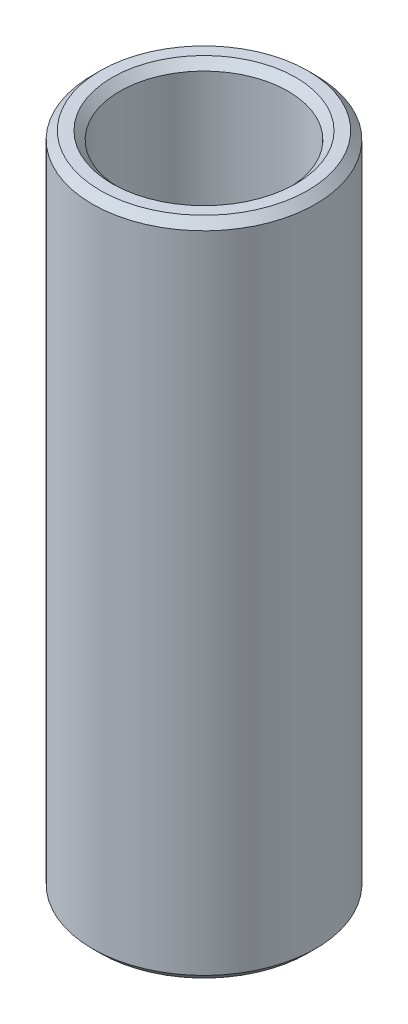
ISO-10303-21;
HEADER;
FILE_DESCRIPTION(('STEP AP214'),'2;1');
FILE_NAME('part.step','',(''),(''),'','','');
FILE_SCHEMA(('AUTOMOTIVE_DESIGN { 1 0 10303 214 1 1 1 1 }'));
ENDSEC;
DATA;
#1=APPLICATION_CONTEXT('core data for automotive mechanical design processes');
#2=APPLICATION_PROTOCOL_DEFINITION('international standard','automotive_design',2000,#1);
#3=PRODUCT_CONTEXT('',#1,'mechanical');
#4=PRODUCT('Part','Part','',(#3));
#5=PRODUCT_RELATED_PRODUCT_CATEGORY('part','',(#4));
#6=PRODUCT_DEFINITION_FORMATION('','',#4);
#7=PRODUCT_DEFINITION_CONTEXT('part definition',#1,'design');
#8=PRODUCT_DEFINITION('design','',#6,#7);
#9=PRODUCT_DEFINITION_SHAPE('','',#8);
#10=(LENGTH_UNIT() NAMED_UNIT(*) SI_UNIT(.MILLI.,.METRE.));
#11=(NAMED_UNIT(*) PLANE_ANGLE_UNIT() SI_UNIT($,.RADIAN.));
#12=(NAMED_UNIT(*) SI_UNIT($,.STERADIAN.) SOLID_ANGLE_UNIT());
#13=UNCERTAINTY_MEASURE_WITH_UNIT(LENGTH_MEASURE(1.E-05),#10,'distance_accuracy_value','');
#14=(GEOMETRIC_REPRESENTATION_CONTEXT(3) GLOBAL_UNCERTAINTY_ASSIGNED_CONTEXT((#13)) GLOBAL_UNIT_ASSIGNED_CONTEXT((#10,
#11,#12)) REPRESENTATION_CONTEXT('',''));
#15=CARTESIAN_POINT('',(0.,0.,0.));
#16=DIRECTION('',(0.,0.,1.));
#17=DIRECTION('',(1.,0.,0.));
#18=AXIS2_PLACEMENT_3D('',#15,#16,#17);
#19=CARTESIAN_POINT('',(0.,88.7654686601397,0.));
#20=DIRECTION('',(0.,-1.,0.));
#21=DIRECTION('',(0.,0.,-1.));
#22=AXIS2_PLACEMENT_3D('',#19,#20,#21);
#23=CYLINDRICAL_SURFACE('',#22,15.);
#24=CARTESIAN_POINT('',(0.,1.06064655763148,0.));
#25=DIRECTION('',(0.,1.,0.));
#26=DIRECTION('',(0.,0.,1.));
#27=AXIS2_PLACEMENT_3D('',#24,#25,#26);
#28=CIRCLE('',#27,15.);
#29=CARTESIAN_POINT('',(0.,1.06064655763148,15.));
#30=VERTEX_POINT('',#29);
#31=EDGE_CURVE('E10',#30,#30,#28,.T.);
#32=ORIENTED_EDGE('',*,*,#31,.T.);
#33=EDGE_LOOP('',(#32));
#34=FACE_BOUND('',#33,.T.);
#35=CARTESIAN_POINT('',(0.,87.7048221025082,0.));
#36=DIRECTION('',(0.,1.,0.));
#37=DIRECTION('',(0.,0.,1.));
#38=AXIS2_PLACEMENT_3D('',#35,#36,#37);
#39=CIRCLE('',#38,15.);
#40=CARTESIAN_POINT('',(0.,87.7048221025082,15.));
#41=VERTEX_POINT('',#40);
#42=EDGE_CURVE('E50',#41,#41,#39,.F.);
#43=ORIENTED_EDGE('',*,*,#42,.T.);
#44=EDGE_LOOP('',(#43));
#45=FACE_BOUND('',#44,.T.);
#46=ADVANCED_FACE('F39',(#34,#45),#23,.T.);
#47=CARTESIAN_POINT('',(0.,88.7654686601397,0.));
#48=DIRECTION('',(0.,1.,0.));
#49=DIRECTION('',(0.,0.,1.));
#50=AXIS2_PLACEMENT_3D('',#47,#48,#49);
#51=PLANE('',#50);
#52=CARTESIAN_POINT('',(0.,88.7654686601397,0.));
#53=DIRECTION('',(0.,1.,0.));
#54=DIRECTION('',(0.,0.,1.));
#55=AXIS2_PLACEMENT_3D('',#52,#53,#54);
#56=CIRCLE('',#55,12.3583901992208);
#57=CARTESIAN_POINT('',(0.,88.7654686601397,12.3583901992208));
#58=VERTEX_POINT('',#57);
#59=EDGE_CURVE('E58',#58,#58,#56,.F.);
#60=ORIENTED_EDGE('',*,*,#59,.T.);
#61=EDGE_LOOP('',(#60));
#62=FACE_BOUND('',#61,.T.);
#63=CARTESIAN_POINT('',(0.,88.7654686601397,0.));
#64=DIRECTION('',(0.,1.,0.));
#65=DIRECTION('',(0.,0.,1.));
#66=AXIS2_PLACEMENT_3D('',#63,#64,#65);
#67=CIRCLE('',#66,13.9393534423685);
#68=CARTESIAN_POINT('',(0.,88.7654686601397,13.9393534423685));
#69=VERTEX_POINT('',#68);
#70=EDGE_CURVE('E61',#69,#69,#67,.T.);
#71=ORIENTED_EDGE('',*,*,#70,.T.);
#72=EDGE_LOOP('',(#71));
#73=FACE_BOUND('',#72,.T.);
#74=ADVANCED_FACE('F88',(#62,#73),#51,.T.);
#75=CARTESIAN_POINT('',(0.,0.,0.));
#76=DIRECTION('',(0.,1.,0.));
#77=DIRECTION('',(0.,0.,1.));
#78=AXIS2_PLACEMENT_3D('',#75,#76,#77);
#79=PLANE('',#78);
#80=CARTESIAN_POINT('',(0.,0.,0.));
#81=DIRECTION('',(0.,1.,0.));
#82=DIRECTION('',(0.,0.,1.));
#83=AXIS2_PLACEMENT_3D('',#80,#81,#82);
#84=CIRCLE('',#83,12.3583901992208);
#85=CARTESIAN_POINT('',(0.,0.,12.3583901992208));
#86=VERTEX_POINT('',#85);
#87=EDGE_CURVE('E51',#86,#86,#84,.T.);
#88=ORIENTED_EDGE('',*,*,#87,.T.);
#89=EDGE_LOOP('',(#88));
#90=FACE_BOUND('',#89,.T.);
#91=CARTESIAN_POINT('',(0.,0.,0.));
#92=DIRECTION('',(0.,1.,0.));
#93=DIRECTION('',(0.,0.,1.));
#94=AXIS2_PLACEMENT_3D('',#91,#92,#93);
#95=CIRCLE('',#94,13.9393534423685);
#96=CARTESIAN_POINT('',(0.,0.,13.9393534423685));
#97=VERTEX_POINT('',#96);
#98=EDGE_CURVE('E54',#97,#97,#95,.F.);
#99=ORIENTED_EDGE('',*,*,#98,.T.);
#100=EDGE_LOOP('',(#99));
#101=FACE_BOUND('',#100,.T.);
#102=ADVANCED_FACE('F83',(#90,#101),#79,.F.);
#103=CARTESIAN_POINT('',(0.,88.7654686601397,0.));
#104=DIRECTION('',(0.,-1.,0.));
#105=DIRECTION('',(0.,0.,-1.));
#106=AXIS2_PLACEMENT_3D('',#103,#104,#105);
#107=CYLINDRICAL_SURFACE('',#106,11.2977436415893);
#108=CARTESIAN_POINT('',(0.,87.7048221025082,0.));
#109=DIRECTION('',(0.,1.,0.));
#110=DIRECTION('',(0.,0.,1.));
#111=AXIS2_PLACEMENT_3D('',#108,#109,#110);
#112=CIRCLE('',#111,11.2977436415893);
#113=CARTESIAN_POINT('',(0.,87.7048221025082,11.2977436415893));
#114=VERTEX_POINT('',#113);
#115=EDGE_CURVE('E67',#114,#114,#112,.T.);
#116=ORIENTED_EDGE('',*,*,#115,.T.);
#117=EDGE_LOOP('',(#116));
#118=FACE_BOUND('',#117,.T.);
#119=CARTESIAN_POINT('',(0.,1.06064655763152,0.));
#120=DIRECTION('',(0.,1.,0.));
#121=DIRECTION('',(0.,0.,1.));
#122=AXIS2_PLACEMENT_3D('',#119,#120,#121);
#123=CIRCLE('',#122,11.2977436415893);
#124=CARTESIAN_POINT('',(0.,1.06064655763152,11.2977436415893));
#125=VERTEX_POINT('',#124);
#126=EDGE_CURVE('E69',#125,#125,#123,.F.);
#127=ORIENTED_EDGE('',*,*,#126,.T.);
#128=EDGE_LOOP('',(#127));
#129=FACE_BOUND('',#128,.T.);
#130=ADVANCED_FACE('F71',(#118,#129),#107,.F.);
#131=CARTESIAN_POINT('',(0.,87.7048221025082,0.));
#132=DIRECTION('',(0.,1.,0.));
#133=DIRECTION('',(0.,0.,1.));
#134=AXIS2_PLACEMENT_3D('',#131,#132,#133);
#135=CONICAL_SURFACE('',#134,11.2977436415893,0.78539816339745);
#136=ORIENTED_EDGE('',*,*,#59,.F.);
#137=EDGE_LOOP('',(#136));
#138=FACE_BOUND('',#137,.T.);
#139=ORIENTED_EDGE('',*,*,#115,.F.);
#140=EDGE_LOOP('',(#139));
#141=FACE_BOUND('',#140,.T.);
#142=ADVANCED_FACE('F77',(#138,#141),#135,.F.);
#143=CARTESIAN_POINT('',(0.,0.,0.));
#144=DIRECTION('',(0.,-1.,0.));
#145=DIRECTION('',(0.,0.,-1.));
#146=AXIS2_PLACEMENT_3D('',#143,#144,#145);
#147=CONICAL_SURFACE('',#146,12.3583901992208,0.785398163397444);
#148=ORIENTED_EDGE('',*,*,#126,.F.);
#149=EDGE_LOOP('',(#148));
#150=FACE_BOUND('',#149,.T.);
#151=ORIENTED_EDGE('',*,*,#87,.F.);
#152=EDGE_LOOP('',(#151));
#153=FACE_BOUND('',#152,.T.);
#154=ADVANCED_FACE('F73',(#150,#153),#147,.F.);
#155=CARTESIAN_POINT('',(0.,1.06064655763148,0.));
#156=DIRECTION('',(0.,1.,0.));
#157=DIRECTION('',(0.,0.,1.));
#158=AXIS2_PLACEMENT_3D('',#155,#156,#157);
#159=CONICAL_SURFACE('',#158,15.,0.785398163397452);
#160=ORIENTED_EDGE('',*,*,#98,.F.);
#161=EDGE_LOOP('',(#160));
#162=FACE_BOUND('',#161,.T.);
#163=ORIENTED_EDGE('',*,*,#31,.F.);
#164=EDGE_LOOP('',(#163));
#165=FACE_BOUND('',#164,.T.);
#166=ADVANCED_FACE('F76',(#162,#165),#159,.T.);
#167=CARTESIAN_POINT('',(0.,88.7654686601397,0.));
#168=DIRECTION('',(0.,-1.,0.));
#169=DIRECTION('',(0.,0.,-1.));
#170=AXIS2_PLACEMENT_3D('',#167,#168,#169);
#171=CONICAL_SURFACE('',#170,13.9393534423685,0.785398163397455);
#172=ORIENTED_EDGE('',*,*,#42,.F.);
#173=EDGE_LOOP('',(#172));
#174=FACE_BOUND('',#173,.T.);
#175=ORIENTED_EDGE('',*,*,#70,.F.);
#176=EDGE_LOOP('',(#175));
#177=FACE_BOUND('',#176,.T.);
#178=ADVANCED_FACE('F45',(#174,#177),#171,.T.);
#179=CLOSED_SHELL('',(#46,#74,#102,#130,#142,#154,#166,#178));
#180=MANIFOLD_SOLID_BREP('B2',#179);
#181=ADVANCED_BREP_SHAPE_REPRESENTATION('',(#18,#180),#14);
#182=SHAPE_DEFINITION_REPRESENTATION(#9,#181);
ENDSEC;
END-ISO-10303-21;
